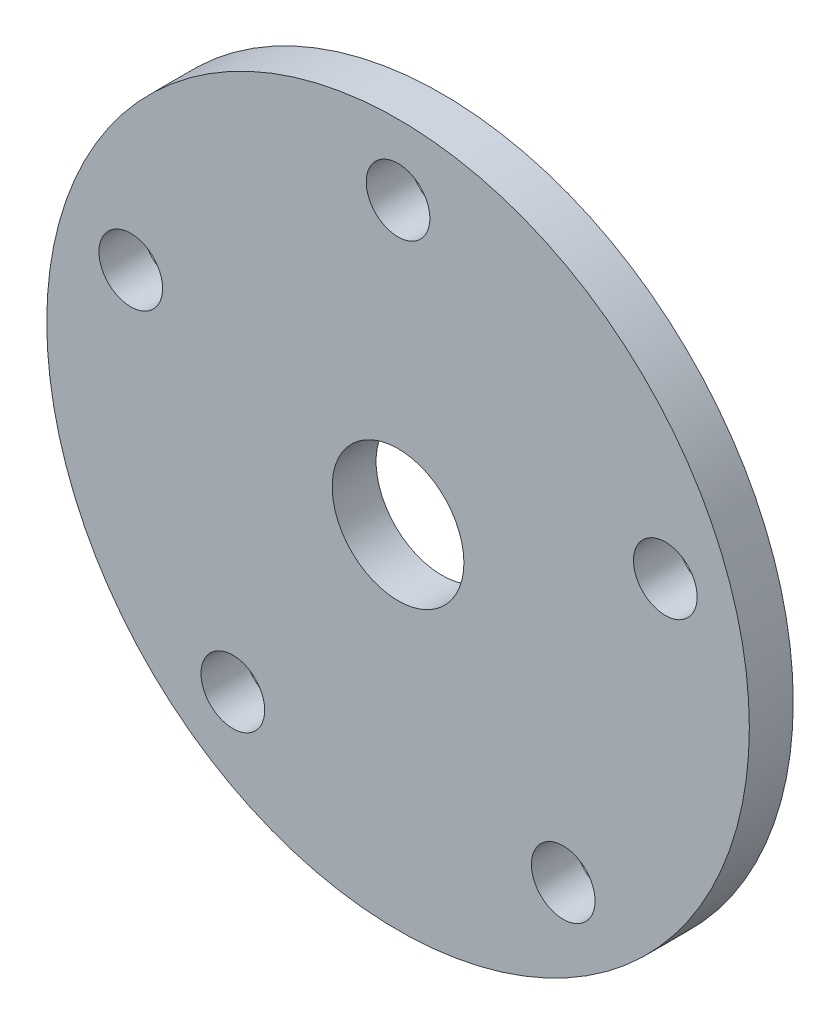
ISO-10303-21;
HEADER;
FILE_DESCRIPTION(('STEP AP214'),'2;1');
FILE_NAME('part.step','',(''),(''),'','','');
FILE_SCHEMA(('AUTOMOTIVE_DESIGN { 1 0 10303 214 1 1 1 1 }'));
ENDSEC;
DATA;
#1=APPLICATION_CONTEXT('core data for automotive mechanical design processes');
#2=APPLICATION_PROTOCOL_DEFINITION('international standard','automotive_design',2000,#1);
#3=PRODUCT_CONTEXT('',#1,'mechanical');
#4=PRODUCT('Part','Part','',(#3));
#5=PRODUCT_RELATED_PRODUCT_CATEGORY('part','',(#4));
#6=PRODUCT_DEFINITION_FORMATION('','',#4);
#7=PRODUCT_DEFINITION_CONTEXT('part definition',#1,'design');
#8=PRODUCT_DEFINITION('design','',#6,#7);
#9=PRODUCT_DEFINITION_SHAPE('','',#8);
#10=(LENGTH_UNIT() NAMED_UNIT(*) SI_UNIT(.MILLI.,.METRE.));
#11=(NAMED_UNIT(*) PLANE_ANGLE_UNIT() SI_UNIT($,.RADIAN.));
#12=(NAMED_UNIT(*) SI_UNIT($,.STERADIAN.) SOLID_ANGLE_UNIT());
#13=UNCERTAINTY_MEASURE_WITH_UNIT(LENGTH_MEASURE(1.E-05),#10,'distance_accuracy_value','');
#14=(GEOMETRIC_REPRESENTATION_CONTEXT(3) GLOBAL_UNCERTAINTY_ASSIGNED_CONTEXT((#13)) GLOBAL_UNIT_ASSIGNED_CONTEXT((#10,
#11,#12)) REPRESENTATION_CONTEXT('',''));
#15=CARTESIAN_POINT('',(0.,0.,0.));
#16=DIRECTION('',(0.,0.,1.));
#17=DIRECTION('',(1.,0.,0.));
#18=AXIS2_PLACEMENT_3D('',#15,#16,#17);
#19=CARTESIAN_POINT('',(0.,0.,5.));
#20=DIRECTION('',(0.,0.,1.));
#21=DIRECTION('',(1.,0.,0.));
#22=AXIS2_PLACEMENT_3D('',#19,#20,#21);
#23=PLANE('',#22);
#24=CARTESIAN_POINT('',(60.8676170428896,19.7770876399973,5.));
#25=DIRECTION('',(0.,0.,1.));
#26=DIRECTION('',(0.309016994374958,-0.95105651629515,0.));
#27=AXIS2_PLACEMENT_3D('',#24,#25,#26);
#28=CIRCLE('',#27,7.25);
#29=CARTESIAN_POINT('',(63.1079902521081,12.8819278968575,5.));
#30=VERTEX_POINT('',#29);
#31=EDGE_CURVE('E74',#30,#30,#28,.T.);
#32=ORIENTED_EDGE('',*,*,#31,.F.);
#33=EDGE_LOOP('',(#32));
#34=FACE_BOUND('',#33,.T.);
#35=CARTESIAN_POINT('',(37.6182561467187,-51.7770876399963,5.));
#36=DIRECTION('',(0.,0.,1.));
#37=DIRECTION('',(-0.809016994374942,-0.58778525229248,0.));
#38=AXIS2_PLACEMENT_3D('',#35,#36,#37);
#39=CIRCLE('',#38,7.25);
#40=CARTESIAN_POINT('',(31.7528829375004,-56.0385307191168,5.));
#41=VERTEX_POINT('',#40);
#42=EDGE_CURVE('E68',#41,#41,#39,.T.);
#43=ORIENTED_EDGE('',*,*,#42,.F.);
#44=EDGE_LOOP('',(#43));
#45=FACE_BOUND('',#44,.T.);
#46=CARTESIAN_POINT('',(-37.618256146718,-51.7770876399969,5.));
#47=DIRECTION('',(0.,0.,1.));
#48=DIRECTION('',(-0.809016994374951,0.587785252292469,0.));
#49=AXIS2_PLACEMENT_3D('',#46,#47,#48);
#50=CIRCLE('',#49,7.25);
#51=CARTESIAN_POINT('',(-43.4836293559364,-47.5156445608765,5.));
#52=VERTEX_POINT('',#51);
#53=EDGE_CURVE('E62',#52,#52,#50,.T.);
#54=ORIENTED_EDGE('',*,*,#53,.F.);
#55=EDGE_LOOP('',(#54));
#56=FACE_BOUND('',#55,.T.);
#57=CARTESIAN_POINT('',(-60.8676170428899,19.7770876399965,5.));
#58=DIRECTION('',(0.,0.,1.));
#59=DIRECTION('',(0.309016994374945,0.951056516295155,0.));
#60=AXIS2_PLACEMENT_3D('',#57,#58,#59);
#61=CIRCLE('',#60,7.25);
#62=CARTESIAN_POINT('',(-58.6272438336715,26.6722473831363,5.));
#63=VERTEX_POINT('',#62);
#64=EDGE_CURVE('E56',#63,#63,#61,.T.);
#65=ORIENTED_EDGE('',*,*,#64,.F.);
#66=EDGE_LOOP('',(#65));
#67=FACE_BOUND('',#66,.T.);
#68=CARTESIAN_POINT('',(0.,64.,5.));
#69=DIRECTION('',(0.,0.,1.));
#70=DIRECTION('',(1.,0.,0.));
#71=AXIS2_PLACEMENT_3D('',#68,#69,#70);
#72=CIRCLE('',#71,7.25);
#73=CARTESIAN_POINT('',(7.25,64.,5.));
#74=VERTEX_POINT('',#73);
#75=EDGE_CURVE('E50',#74,#74,#72,.T.);
#76=ORIENTED_EDGE('',*,*,#75,.F.);
#77=EDGE_LOOP('',(#76));
#78=FACE_BOUND('',#77,.T.);
#79=CARTESIAN_POINT('',(0.,0.,5.));
#80=DIRECTION('',(0.,0.,1.));
#81=DIRECTION('',(1.,0.,0.));
#82=AXIS2_PLACEMENT_3D('',#79,#80,#81);
#83=CIRCLE('',#82,80.);
#84=CARTESIAN_POINT('',(80.,0.,5.));
#85=VERTEX_POINT('',#84);
#86=EDGE_CURVE('E10',#85,#85,#83,.T.);
#87=ORIENTED_EDGE('',*,*,#86,.T.);
#88=EDGE_LOOP('',(#87));
#89=FACE_BOUND('',#88,.T.);
#90=CARTESIAN_POINT('',(0.,0.,5.));
#91=DIRECTION('',(0.,0.,1.));
#92=DIRECTION('',(1.,0.,0.));
#93=AXIS2_PLACEMENT_3D('',#90,#91,#92);
#94=CIRCLE('',#93,15.);
#95=CARTESIAN_POINT('',(15.,0.,5.));
#96=VERTEX_POINT('',#95);
#97=EDGE_CURVE('E42',#96,#96,#94,.T.);
#98=ORIENTED_EDGE('',*,*,#97,.F.);
#99=EDGE_LOOP('',(#98));
#100=FACE_BOUND('',#99,.T.);
#101=ADVANCED_FACE('F31',(#34,#45,#56,#67,#78,#89,#100),#23,.T.);
#102=CARTESIAN_POINT('',(0.,0.,-5.));
#103=DIRECTION('',(0.,0.,1.));
#104=DIRECTION('',(1.,0.,0.));
#105=AXIS2_PLACEMENT_3D('',#102,#103,#104);
#106=PLANE('',#105);
#107=CARTESIAN_POINT('',(60.8676170428896,19.7770876399973,-5.));
#108=DIRECTION('',(0.,0.,1.));
#109=DIRECTION('',(0.309016994374958,-0.95105651629515,0.));
#110=AXIS2_PLACEMENT_3D('',#107,#108,#109);
#111=CIRCLE('',#110,7.25);
#112=CARTESIAN_POINT('',(63.1079902521081,12.8819278968575,-5.));
#113=VERTEX_POINT('',#112);
#114=EDGE_CURVE('E71',#113,#113,#111,.T.);
#115=ORIENTED_EDGE('',*,*,#114,.T.);
#116=EDGE_LOOP('',(#115));
#117=FACE_BOUND('',#116,.T.);
#118=CARTESIAN_POINT('',(37.6182561467187,-51.7770876399963,-5.));
#119=DIRECTION('',(0.,0.,1.));
#120=DIRECTION('',(-0.809016994374942,-0.58778525229248,0.));
#121=AXIS2_PLACEMENT_3D('',#118,#119,#120);
#122=CIRCLE('',#121,7.25);
#123=CARTESIAN_POINT('',(31.7528829375004,-56.0385307191168,-5.));
#124=VERTEX_POINT('',#123);
#125=EDGE_CURVE('E65',#124,#124,#122,.T.);
#126=ORIENTED_EDGE('',*,*,#125,.T.);
#127=EDGE_LOOP('',(#126));
#128=FACE_BOUND('',#127,.T.);
#129=CARTESIAN_POINT('',(-37.618256146718,-51.7770876399969,-5.));
#130=DIRECTION('',(0.,0.,1.));
#131=DIRECTION('',(-0.809016994374951,0.587785252292469,0.));
#132=AXIS2_PLACEMENT_3D('',#129,#130,#131);
#133=CIRCLE('',#132,7.25);
#134=CARTESIAN_POINT('',(-43.4836293559364,-47.5156445608765,-5.));
#135=VERTEX_POINT('',#134);
#136=EDGE_CURVE('E59',#135,#135,#133,.T.);
#137=ORIENTED_EDGE('',*,*,#136,.T.);
#138=EDGE_LOOP('',(#137));
#139=FACE_BOUND('',#138,.T.);
#140=CARTESIAN_POINT('',(-60.8676170428899,19.7770876399965,-5.));
#141=DIRECTION('',(0.,0.,1.));
#142=DIRECTION('',(0.309016994374945,0.951056516295155,0.));
#143=AXIS2_PLACEMENT_3D('',#140,#141,#142);
#144=CIRCLE('',#143,7.25);
#145=CARTESIAN_POINT('',(-58.6272438336715,26.6722473831363,-5.));
#146=VERTEX_POINT('',#145);
#147=EDGE_CURVE('E53',#146,#146,#144,.T.);
#148=ORIENTED_EDGE('',*,*,#147,.T.);
#149=EDGE_LOOP('',(#148));
#150=FACE_BOUND('',#149,.T.);
#151=CARTESIAN_POINT('',(0.,64.,-5.));
#152=DIRECTION('',(0.,0.,1.));
#153=DIRECTION('',(1.,0.,0.));
#154=AXIS2_PLACEMENT_3D('',#151,#152,#153);
#155=CIRCLE('',#154,7.25);
#156=CARTESIAN_POINT('',(7.25,64.,-5.));
#157=VERTEX_POINT('',#156);
#158=EDGE_CURVE('E47',#157,#157,#155,.T.);
#159=ORIENTED_EDGE('',*,*,#158,.T.);
#160=EDGE_LOOP('',(#159));
#161=FACE_BOUND('',#160,.T.);
#162=CARTESIAN_POINT('',(0.,0.,-5.));
#163=DIRECTION('',(0.,0.,1.));
#164=DIRECTION('',(1.,0.,0.));
#165=AXIS2_PLACEMENT_3D('',#162,#163,#164);
#166=CIRCLE('',#165,80.);
#167=CARTESIAN_POINT('',(80.,0.,-5.));
#168=VERTEX_POINT('',#167);
#169=EDGE_CURVE('E35',#168,#168,#166,.T.);
#170=ORIENTED_EDGE('',*,*,#169,.F.);
#171=EDGE_LOOP('',(#170));
#172=FACE_BOUND('',#171,.T.);
#173=CARTESIAN_POINT('',(0.,0.,-5.));
#174=DIRECTION('',(0.,0.,1.));
#175=DIRECTION('',(1.,0.,0.));
#176=AXIS2_PLACEMENT_3D('',#173,#174,#175);
#177=CIRCLE('',#176,15.);
#178=CARTESIAN_POINT('',(15.,0.,-5.));
#179=VERTEX_POINT('',#178);
#180=EDGE_CURVE('E44',#179,#179,#177,.T.);
#181=ORIENTED_EDGE('',*,*,#180,.T.);
#182=EDGE_LOOP('',(#181));
#183=FACE_BOUND('',#182,.T.);
#184=ADVANCED_FACE('F80',(#117,#128,#139,#150,#161,#172,#183),#106,.F.);
#185=CARTESIAN_POINT('',(0.,0.,5.));
#186=DIRECTION('',(0.,0.,-1.));
#187=DIRECTION('',(-1.,0.,0.));
#188=AXIS2_PLACEMENT_3D('',#185,#186,#187);
#189=CYLINDRICAL_SURFACE('',#188,80.);
#190=ORIENTED_EDGE('',*,*,#86,.F.);
#191=EDGE_LOOP('',(#190));
#192=FACE_BOUND('',#191,.T.);
#193=ORIENTED_EDGE('',*,*,#169,.T.);
#194=EDGE_LOOP('',(#193));
#195=FACE_BOUND('',#194,.T.);
#196=ADVANCED_FACE('F33',(#192,#195),#189,.T.);
#197=CARTESIAN_POINT('',(0.,0.,5.));
#198=DIRECTION('',(0.,0.,-1.));
#199=DIRECTION('',(-1.,0.,0.));
#200=AXIS2_PLACEMENT_3D('',#197,#198,#199);
#201=CYLINDRICAL_SURFACE('',#200,15.);
#202=ORIENTED_EDGE('',*,*,#97,.T.);
#203=EDGE_LOOP('',(#202));
#204=FACE_BOUND('',#203,.T.);
#205=ORIENTED_EDGE('',*,*,#180,.F.);
#206=EDGE_LOOP('',(#205));
#207=FACE_BOUND('',#206,.T.);
#208=ADVANCED_FACE('F103',(#204,#207),#201,.F.);
#209=CARTESIAN_POINT('',(0.,64.,-5.));
#210=DIRECTION('',(0.,0.,1.));
#211=DIRECTION('',(1.,0.,0.));
#212=AXIS2_PLACEMENT_3D('',#209,#210,#211);
#213=CYLINDRICAL_SURFACE('',#212,7.25);
#214=ORIENTED_EDGE('',*,*,#158,.F.);
#215=EDGE_LOOP('',(#214));
#216=FACE_BOUND('',#215,.T.);
#217=ORIENTED_EDGE('',*,*,#75,.T.);
#218=EDGE_LOOP('',(#217));
#219=FACE_BOUND('',#218,.T.);
#220=ADVANCED_FACE('F106',(#216,#219),#213,.F.);
#221=CARTESIAN_POINT('',(-60.8676170428899,19.7770876399965,-5.));
#222=DIRECTION('',(0.,0.,1.));
#223=DIRECTION('',(1.,0.,0.));
#224=AXIS2_PLACEMENT_3D('',#221,#222,#223);
#225=CYLINDRICAL_SURFACE('',#224,7.25);
#226=ORIENTED_EDGE('',*,*,#147,.F.);
#227=EDGE_LOOP('',(#226));
#228=FACE_BOUND('',#227,.T.);
#229=ORIENTED_EDGE('',*,*,#64,.T.);
#230=EDGE_LOOP('',(#229));
#231=FACE_BOUND('',#230,.T.);
#232=ADVANCED_FACE('F118',(#228,#231),#225,.F.);
#233=CARTESIAN_POINT('',(-37.618256146718,-51.7770876399969,-5.));
#234=DIRECTION('',(0.,0.,1.));
#235=DIRECTION('',(1.,0.,0.));
#236=AXIS2_PLACEMENT_3D('',#233,#234,#235);
#237=CYLINDRICAL_SURFACE('',#236,7.25);
#238=ORIENTED_EDGE('',*,*,#136,.F.);
#239=EDGE_LOOP('',(#238));
#240=FACE_BOUND('',#239,.T.);
#241=ORIENTED_EDGE('',*,*,#53,.T.);
#242=EDGE_LOOP('',(#241));
#243=FACE_BOUND('',#242,.T.);
#244=ADVANCED_FACE('F122',(#240,#243),#237,.F.);
#245=CARTESIAN_POINT('',(37.6182561467187,-51.7770876399963,-5.));
#246=DIRECTION('',(0.,0.,1.));
#247=DIRECTION('',(1.,0.,0.));
#248=AXIS2_PLACEMENT_3D('',#245,#246,#247);
#249=CYLINDRICAL_SURFACE('',#248,7.25);
#250=ORIENTED_EDGE('',*,*,#125,.F.);
#251=EDGE_LOOP('',(#250));
#252=FACE_BOUND('',#251,.T.);
#253=ORIENTED_EDGE('',*,*,#42,.T.);
#254=EDGE_LOOP('',(#253));
#255=FACE_BOUND('',#254,.T.);
#256=ADVANCED_FACE('F86',(#252,#255),#249,.F.);
#257=CARTESIAN_POINT('',(60.8676170428896,19.7770876399973,-5.));
#258=DIRECTION('',(0.,0.,1.));
#259=DIRECTION('',(1.,0.,0.));
#260=AXIS2_PLACEMENT_3D('',#257,#258,#259);
#261=CYLINDRICAL_SURFACE('',#260,7.25);
#262=ORIENTED_EDGE('',*,*,#114,.F.);
#263=EDGE_LOOP('',(#262));
#264=FACE_BOUND('',#263,.T.);
#265=ORIENTED_EDGE('',*,*,#31,.T.);
#266=EDGE_LOOP('',(#265));
#267=FACE_BOUND('',#266,.T.);
#268=ADVANCED_FACE('F83',(#264,#267),#261,.F.);
#269=CLOSED_SHELL('',(#101,#184,#196,#208,#220,#232,#244,#256,#268));
#270=MANIFOLD_SOLID_BREP('B2',#269);
#271=ADVANCED_BREP_SHAPE_REPRESENTATION('',(#18,#270),#14);
#272=SHAPE_DEFINITION_REPRESENTATION(#9,#271);
ENDSEC;
END-ISO-10303-21;
